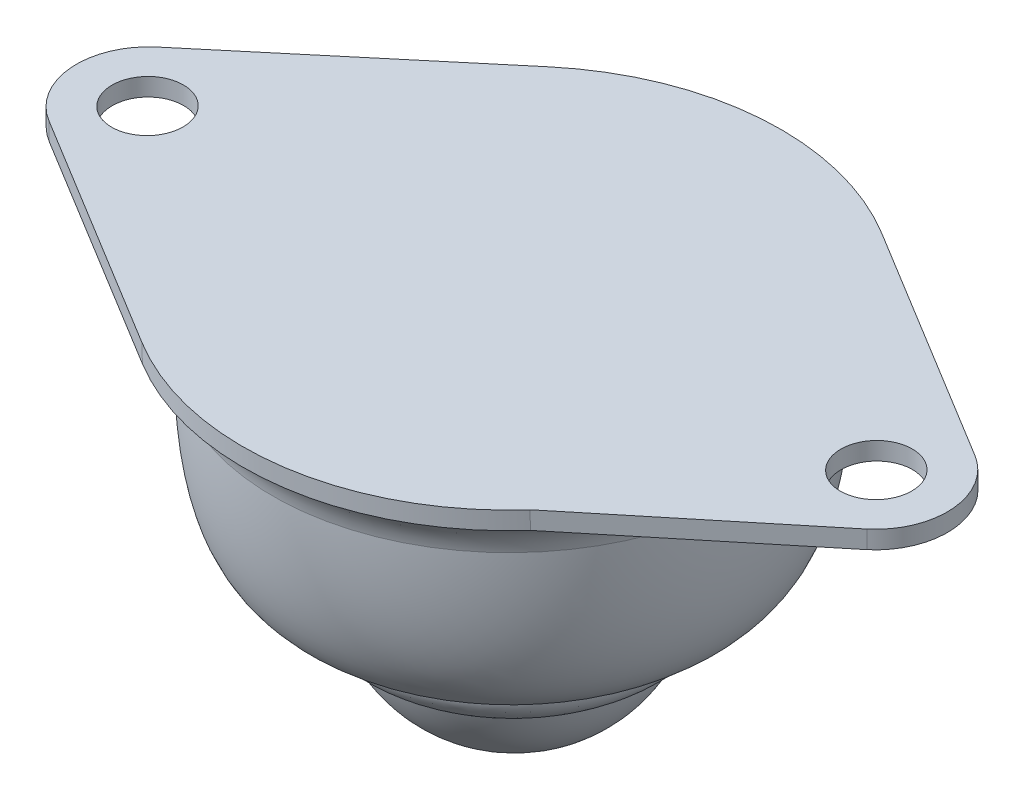
ISO-10303-21;
HEADER;
FILE_DESCRIPTION(('STEP AP214'),'2;1');
FILE_NAME('part.step','',(''),(''),'','','');
FILE_SCHEMA(('AUTOMOTIVE_DESIGN { 1 0 10303 214 1 1 1 1 }'));
ENDSEC;
DATA;
#1=APPLICATION_CONTEXT('core data for automotive mechanical design processes');
#2=APPLICATION_PROTOCOL_DEFINITION('international standard','automotive_design',2000,#1);
#3=PRODUCT_CONTEXT('',#1,'mechanical');
#4=PRODUCT('Part','Part','',(#3));
#5=PRODUCT_RELATED_PRODUCT_CATEGORY('part','',(#4));
#6=PRODUCT_DEFINITION_FORMATION('','',#4);
#7=PRODUCT_DEFINITION_CONTEXT('part definition',#1,'design');
#8=PRODUCT_DEFINITION('design','',#6,#7);
#9=PRODUCT_DEFINITION_SHAPE('','',#8);
#10=(LENGTH_UNIT() NAMED_UNIT(*) SI_UNIT(.MILLI.,.METRE.));
#11=(NAMED_UNIT(*) PLANE_ANGLE_UNIT() SI_UNIT($,.RADIAN.));
#12=(NAMED_UNIT(*) SI_UNIT($,.STERADIAN.) SOLID_ANGLE_UNIT());
#13=UNCERTAINTY_MEASURE_WITH_UNIT(LENGTH_MEASURE(1.E-05),#10,'distance_accuracy_value','');
#14=(GEOMETRIC_REPRESENTATION_CONTEXT(3) GLOBAL_UNCERTAINTY_ASSIGNED_CONTEXT((#13)) GLOBAL_UNIT_ASSIGNED_CONTEXT((#10,
#11,#12)) REPRESENTATION_CONTEXT('',''));
#15=CARTESIAN_POINT('',(0.,0.,0.));
#16=DIRECTION('',(0.,0.,1.));
#17=DIRECTION('',(1.,0.,0.));
#18=AXIS2_PLACEMENT_3D('',#15,#16,#17);
#19=CARTESIAN_POINT('',(20.6055140305361,-15.2825221419001,143.883208807288));
#20=DIRECTION('',(0.,0.999945430194424,0.0104468480073327));
#21=DIRECTION('',(0.0713413271941377,-0.0104202290339659,0.997397530506798));
#22=AXIS2_PLACEMENT_3D('',#19,#20,#21);
#23=PLANE('',#22);
#24=CARTESIAN_POINT('',(39.5571012945976,-15.2683615938651,142.527797559164));
#25=DIRECTION('',(0.,0.999945430194424,0.0104468480073327));
#26=DIRECTION('',(0.0713413271941377,-0.0104202290339659,0.997397530506798));
#27=AXIS2_PLACEMENT_3D('',#24,#25,#26);
#28=CIRCLE('',#27,2.);
#29=CARTESIAN_POINT('',(39.6997839489859,-15.2892020519331,144.522592620178));
#30=VERTEX_POINT('',#29);
#31=EDGE_CURVE('E112',#30,#30,#28,.T.);
#32=ORIENTED_EDGE('',*,*,#31,.T.);
#33=EDGE_LOOP('',(#32));
#34=FACE_BOUND('',#33,.T.);
#35=CARTESIAN_POINT('',(20.6055140305361,-15.2825221419001,143.883208807288));
#36=DIRECTION('',(0.,-0.999945430194424,-0.0104468480073327));
#37=DIRECTION('',(-0.0713413271941377,0.0104202290339659,-0.997397530506798));
#38=AXIS2_PLACEMENT_3D('',#35,#36,#37);
#39=CIRCLE('',#38,15.);
#40=CARTESIAN_POINT('',(28.3950586243151,-15.1486055318455,131.065055220945));
#41=VERTEX_POINT('',#40);
#42=CARTESIAN_POINT('',(31.7081173338485,-15.3878915387519,153.968896546827));
#43=VERTEX_POINT('',#42);
#44=EDGE_CURVE('E26',#41,#43,#39,.T.);
#45=ORIENTED_EDGE('',*,*,#44,.F.);
#46=DIRECTION('',(0.854590207244327,-0.00542507922783681,0.519274634656335));
#47=VECTOR('',#46,1.);
#48=CARTESIAN_POINT('',(28.3950586243151,-15.1486055318455,131.065055220945));
#49=LINE('',#48,#47);
#50=CARTESIAN_POINT('',(41.634313186272,-15.2326504978506,139.109623269472));
#51=VERTEX_POINT('',#50);
#52=EDGE_CURVE('E115',#41,#51,#49,.T.);
#53=ORIENTED_EDGE('',*,*,#52,.T.);
#54=CARTESIAN_POINT('',(39.5571012945976,-15.2683615938651,142.527797559164));
#55=DIRECTION('',(0.,0.999945430194424,0.0104468480073327));
#56=DIRECTION('',(0.0713413271941377,-0.0104202290339659,0.997397530506798));
#57=AXIS2_PLACEMENT_3D('',#54,#55,#56);
#58=CIRCLE('',#57,4.);
#59=CARTESIAN_POINT('',(42.112644401564,-15.300508701753,145.604836069142));
#60=VERTEX_POINT('',#59);
#61=EDGE_CURVE('E133',#60,#51,#58,.T.);
#62=ORIENTED_EDGE('',*,*,#61,.F.);
#63=DIRECTION('',(-0.779372261403576,-0.00654558913023889,0.626526961445088));
#64=VECTOR('',#63,1.);
#65=CARTESIAN_POINT('',(29.8895175935521,-15.4031651214567,155.430844611697));
#66=LINE('',#65,#64);
#67=EDGE_CURVE('E131',#60,#43,#66,.T.);
#68=ORIENTED_EDGE('',*,*,#67,.T.);
#69=EDGE_LOOP('',(#45,#53,#62,#68));
#70=FACE_BOUND('',#69,.T.);
#71=ADVANCED_FACE('F15',(#34,#70),#23,.F.);
#72=CARTESIAN_POINT('',(1.65392676647455,-15.296682689935,145.238620055412));
#73=DIRECTION('',(0.,0.999945430194424,0.0104468480073327));
#74=DIRECTION('',(0.0713413271941377,-0.0104202290339659,0.997397530506798));
#75=AXIS2_PLACEMENT_3D('',#72,#73,#74);
#76=CIRCLE('',#75,2.);
#77=CARTESIAN_POINT('',(1.79660942086283,-15.3175231480029,147.233415116425));
#78=VERTEX_POINT('',#77);
#79=EDGE_CURVE('E109',#78,#78,#76,.T.);
#80=ORIENTED_EDGE('',*,*,#79,.T.);
#81=EDGE_LOOP('',(#80));
#82=FACE_BOUND('',#81,.T.);
#83=CARTESIAN_POINT('',(12.815969436757,-15.4164387519546,156.701362393631));
#84=VERTEX_POINT('',#83);
#85=CARTESIAN_POINT('',(11.0708929812672,-15.1615500771406,132.304073813413));
#86=VERTEX_POINT('',#85);
#87=EDGE_CURVE('E10',#84,#86,#39,.T.);
#88=ORIENTED_EDGE('',*,*,#87,.F.);
#89=DIRECTION('',(0.854590207244327,-0.0054250792278368,0.519274634656334));
#90=VECTOR('',#89,1.);
#91=CARTESIAN_POINT('',(12.815969436757,-15.4164387519546,156.701362393631));
#92=LINE('',#91,#90);
#93=CARTESIAN_POINT('',(-0.423285125199856,-15.3323937859495,148.656794345103));
#94=VERTEX_POINT('',#93);
#95=EDGE_CURVE('E127',#94,#84,#92,.T.);
#96=ORIENTED_EDGE('',*,*,#95,.F.);
#97=CARTESIAN_POINT('',(1.65392676647455,-15.296682689935,145.238620055412));
#98=DIRECTION('',(0.,0.999945430194424,0.0104468480073327));
#99=DIRECTION('',(0.0713413271941377,-0.0104202290339659,0.997397530506798));
#100=AXIS2_PLACEMENT_3D('',#97,#98,#99);
#101=CIRCLE('',#100,4.);
#102=CARTESIAN_POINT('',(-0.888638846663823,-15.2644234726658,142.150850723712));
#103=VERTEX_POINT('',#102);
#104=EDGE_CURVE('E124',#103,#94,#101,.T.);
#105=ORIENTED_EDGE('',*,*,#104,.F.);
#106=DIRECTION('',(0.771984459966905,0.00664044912728166,-0.6356067164568));
#107=VECTOR('',#106,1.);
#108=CARTESIAN_POINT('',(11.0708929812672,-15.1615500771406,132.304073813413));
#109=LINE('',#108,#107);
#110=EDGE_CURVE('E121',#103,#86,#109,.T.);
#111=ORIENTED_EDGE('',*,*,#110,.T.);
#112=EDGE_LOOP('',(#88,#96,#105,#111));
#113=FACE_BOUND('',#112,.T.);
#114=ADVANCED_FACE('F208',(#82,#113),#23,.F.);
#115=CARTESIAN_POINT('',(28.3950586243151,-14.1486601016511,131.075502068952));
#116=DIRECTION('',(0.519302972918602,0.00892777400363633,-0.854543572422871));
#117=DIRECTION('',(-0.854590207244327,0.00542507922783681,-0.519274634656335));
#118=AXIS2_PLACEMENT_3D('',#115,#116,#117);
#119=PLANE('',#118);
#120=ORIENTED_EDGE('',*,*,#52,.F.);
#121=DIRECTION('',(0.,-0.999945430194424,-0.0104468480073327));
#122=VECTOR('',#121,1.);
#123=CARTESIAN_POINT('',(28.3950586243151,-14.1486601016511,131.075502068952));
#124=LINE('',#123,#122);
#125=CARTESIAN_POINT('',(28.3950586243151,-14.1486601016511,131.075502068952));
#126=VERTEX_POINT('',#125);
#127=EDGE_CURVE('E19',#126,#41,#124,.T.);
#128=ORIENTED_EDGE('',*,*,#127,.F.);
#129=DIRECTION('',(0.854590207244327,-0.00542507922783681,0.519274634656335));
#130=VECTOR('',#129,1.);
#131=CARTESIAN_POINT('',(28.3950586243151,-14.1486601016511,131.075502068952));
#132=LINE('',#131,#130);
#133=CARTESIAN_POINT('',(41.634313186272,-14.2327050676562,139.12007011748));
#134=VERTEX_POINT('',#133);
#135=EDGE_CURVE('E172',#126,#134,#132,.T.);
#136=ORIENTED_EDGE('',*,*,#135,.T.);
#137=DIRECTION('',(0.,-0.999945430194424,-0.0104468480073327));
#138=VECTOR('',#137,1.);
#139=CARTESIAN_POINT('',(41.634313186272,-14.2327050676562,139.12007011748));
#140=LINE('',#139,#138);
#141=EDGE_CURVE('E60',#134,#51,#140,.T.);
#142=ORIENTED_EDGE('',*,*,#141,.T.);
#143=EDGE_LOOP('',(#120,#128,#136,#142));
#144=FACE_BOUND('',#143,.T.);
#145=ADVANCED_FACE('F156',(#144),#119,.T.);
#146=CARTESIAN_POINT('',(20.6055140305361,-14.2825767117056,143.893655655295));
#147=DIRECTION('',(0.,-0.999945430194424,-0.0104468480073327));
#148=DIRECTION('',(-0.0713413271941377,0.0104202290339659,-0.997397530506798));
#149=AXIS2_PLACEMENT_3D('',#146,#147,#148);
#150=CYLINDRICAL_SURFACE('',#149,15.);
#151=CARTESIAN_POINT('',(20.6055140305361,-15.2825221419001,143.883208807288));
#152=DIRECTION('',(0.,0.999945430194424,0.0104468480073327));
#153=DIRECTION('',(0.0713413271941377,-0.0104202290339659,0.997397530506798));
#154=AXIS2_PLACEMENT_3D('',#151,#152,#153);
#155=CIRCLE('',#154,15.);
#156=EDGE_CURVE('E118',#41,#86,#155,.T.);
#157=ORIENTED_EDGE('',*,*,#156,.T.);
#158=DIRECTION('',(0.,-0.999945430194424,-0.0104468480073327));
#159=VECTOR('',#158,1.);
#160=CARTESIAN_POINT('',(11.0708929812672,-14.1616046469462,132.31452066142));
#161=LINE('',#160,#159);
#162=CARTESIAN_POINT('',(11.0708929812672,-14.1616046469462,132.31452066142));
#163=VERTEX_POINT('',#162);
#164=EDGE_CURVE('E143',#163,#86,#161,.T.);
#165=ORIENTED_EDGE('',*,*,#164,.F.);
#166=CARTESIAN_POINT('',(20.6055140305361,-14.2825767117056,143.893655655295));
#167=DIRECTION('',(0.,0.999945430194424,0.0104468480073327));
#168=DIRECTION('',(0.0713413271941377,-0.0104202290339659,0.997397530506798));
#169=AXIS2_PLACEMENT_3D('',#166,#167,#168);
#170=CIRCLE('',#169,15.);
#171=EDGE_CURVE('E153',#126,#163,#170,.T.);
#172=ORIENTED_EDGE('',*,*,#171,.F.);
#173=ORIENTED_EDGE('',*,*,#127,.T.);
#174=EDGE_LOOP('',(#157,#165,#172,#173));
#175=FACE_BOUND('',#174,.T.);
#176=ADVANCED_FACE('F151',(#175),#150,.T.);
#177=CARTESIAN_POINT('',(11.0708929812672,-14.1616046469462,132.31452066142));
#178=DIRECTION('',(-0.635641403284593,0.00806480431729719,-0.771942332925016));
#179=DIRECTION('',(-0.771984459966905,-0.00664044912728166,0.6356067164568));
#180=AXIS2_PLACEMENT_3D('',#177,#178,#179);
#181=PLANE('',#180);
#182=ORIENTED_EDGE('',*,*,#110,.F.);
#183=DIRECTION('',(0.,-0.999945430194424,-0.0104468480073327));
#184=VECTOR('',#183,1.);
#185=CARTESIAN_POINT('',(-0.888638846663823,-14.2644780424714,142.161297571719));
#186=LINE('',#185,#184);
#187=CARTESIAN_POINT('',(-0.888638846663823,-14.2644780424714,142.161297571719));
#188=VERTEX_POINT('',#187);
#189=EDGE_CURVE('E142',#188,#103,#186,.T.);
#190=ORIENTED_EDGE('',*,*,#189,.F.);
#191=DIRECTION('',(0.771984459966905,0.00664044912728166,-0.6356067164568));
#192=VECTOR('',#191,1.);
#193=CARTESIAN_POINT('',(11.0708929812672,-14.1616046469462,132.31452066142));
#194=LINE('',#193,#192);
#195=EDGE_CURVE('E175',#188,#163,#194,.T.);
#196=ORIENTED_EDGE('',*,*,#195,.T.);
#197=ORIENTED_EDGE('',*,*,#164,.T.);
#198=EDGE_LOOP('',(#182,#190,#196,#197));
#199=FACE_BOUND('',#198,.T.);
#200=ADVANCED_FACE('F227',(#199),#181,.T.);
#201=CARTESIAN_POINT('',(1.65392676647455,-14.2967372597406,145.249066903419));
#202=DIRECTION('',(0.,-0.999945430194424,-0.0104468480073327));
#203=DIRECTION('',(-0.0713413271941377,0.0104202290339659,-0.997397530506798));
#204=AXIS2_PLACEMENT_3D('',#201,#202,#203);
#205=CYLINDRICAL_SURFACE('',#204,4.);
#206=ORIENTED_EDGE('',*,*,#104,.T.);
#207=DIRECTION('',(0.,-0.999945430194424,-0.0104468480073327));
#208=VECTOR('',#207,1.);
#209=CARTESIAN_POINT('',(-0.423285125199856,-14.3324483557551,148.667241193111));
#210=LINE('',#209,#208);
#211=CARTESIAN_POINT('',(-0.423285125199856,-14.3324483557551,148.667241193111));
#212=VERTEX_POINT('',#211);
#213=EDGE_CURVE('E139',#212,#94,#210,.T.);
#214=ORIENTED_EDGE('',*,*,#213,.F.);
#215=CARTESIAN_POINT('',(1.65392676647455,-14.2967372597406,145.249066903419));
#216=DIRECTION('',(0.,0.999945430194424,0.0104468480073327));
#217=DIRECTION('',(0.0713413271941377,-0.0104202290339659,0.997397530506798));
#218=AXIS2_PLACEMENT_3D('',#215,#216,#217);
#219=CIRCLE('',#218,4.);
#220=EDGE_CURVE('E177',#188,#212,#219,.T.);
#221=ORIENTED_EDGE('',*,*,#220,.F.);
#222=ORIENTED_EDGE('',*,*,#189,.T.);
#223=EDGE_LOOP('',(#206,#214,#221,#222));
#224=FACE_BOUND('',#223,.T.);
#225=ADVANCED_FACE('F182',(#224),#205,.T.);
#226=CARTESIAN_POINT('',(12.815969436757,-14.4164933217602,156.711809241638));
#227=DIRECTION('',(0.519302972918602,0.00892777400363633,-0.854543572422871));
#228=DIRECTION('',(-0.854590207244327,0.0054250792278368,-0.519274634656334));
#229=AXIS2_PLACEMENT_3D('',#226,#227,#228);
#230=PLANE('',#229);
#231=ORIENTED_EDGE('',*,*,#95,.T.);
#232=DIRECTION('',(0.,-0.999945430194424,-0.0104468480073327));
#233=VECTOR('',#232,1.);
#234=CARTESIAN_POINT('',(12.815969436757,-14.4164933217602,156.711809241638));
#235=LINE('',#234,#233);
#236=CARTESIAN_POINT('',(12.815969436757,-14.4164933217602,156.711809241638));
#237=VERTEX_POINT('',#236);
#238=EDGE_CURVE('E102',#237,#84,#235,.T.);
#239=ORIENTED_EDGE('',*,*,#238,.F.);
#240=DIRECTION('',(0.854590207244327,-0.0054250792278368,0.519274634656334));
#241=VECTOR('',#240,1.);
#242=CARTESIAN_POINT('',(12.815969436757,-14.4164933217602,156.711809241638));
#243=LINE('',#242,#241);
#244=EDGE_CURVE('E87',#212,#237,#243,.T.);
#245=ORIENTED_EDGE('',*,*,#244,.F.);
#246=ORIENTED_EDGE('',*,*,#213,.T.);
#247=EDGE_LOOP('',(#231,#239,#245,#246));
#248=FACE_BOUND('',#247,.T.);
#249=ADVANCED_FACE('F185',(#248),#230,.F.);
#250=CARTESIAN_POINT('',(20.6055140305361,-14.2825767117056,143.893655655295));
#251=DIRECTION('',(0.,-0.999945430194424,-0.0104468480073327));
#252=DIRECTION('',(-0.0713413271941377,0.0104202290339659,-0.997397530506798));
#253=AXIS2_PLACEMENT_3D('',#250,#251,#252);
#254=CYLINDRICAL_SURFACE('',#253,15.);
#255=CARTESIAN_POINT('',(20.6055140305361,-15.2825221419001,143.883208807288));
#256=DIRECTION('',(0.,0.999945430194424,0.0104468480073327));
#257=DIRECTION('',(0.0713413271941377,-0.0104202290339659,0.997397530506798));
#258=AXIS2_PLACEMENT_3D('',#255,#256,#257);
#259=CIRCLE('',#258,15.);
#260=EDGE_CURVE('E98',#84,#43,#259,.T.);
#261=ORIENTED_EDGE('',*,*,#260,.T.);
#262=DIRECTION('',(0.,-0.999945430194424,-0.0104468480073327));
#263=VECTOR('',#262,1.);
#264=CARTESIAN_POINT('',(31.7081173338485,-14.3879461085575,153.979343394834));
#265=LINE('',#264,#263);
#266=CARTESIAN_POINT('',(31.7081173338485,-14.3879461085575,153.979343394834));
#267=VERTEX_POINT('',#266);
#268=EDGE_CURVE('E94',#267,#43,#265,.T.);
#269=ORIENTED_EDGE('',*,*,#268,.F.);
#270=CARTESIAN_POINT('',(20.6055140305361,-14.2825767117056,143.893655655295));
#271=DIRECTION('',(0.,0.999945430194424,0.0104468480073327));
#272=DIRECTION('',(0.0713413271941377,-0.0104202290339659,0.997397530506798));
#273=AXIS2_PLACEMENT_3D('',#270,#271,#272);
#274=CIRCLE('',#273,15.);
#275=EDGE_CURVE('E81',#237,#267,#274,.T.);
#276=ORIENTED_EDGE('',*,*,#275,.F.);
#277=ORIENTED_EDGE('',*,*,#238,.T.);
#278=EDGE_LOOP('',(#261,#269,#276,#277));
#279=FACE_BOUND('',#278,.T.);
#280=ADVANCED_FACE('F95',(#279),#254,.T.);
#281=CARTESIAN_POINT('',(29.8895175935521,-14.4032196912623,155.441291459704));
#282=DIRECTION('',(0.626561152765376,-0.00814198355601444,0.779329731210799));
#283=DIRECTION('',(0.779372261403576,0.00654558913023889,-0.626526961445088));
#284=AXIS2_PLACEMENT_3D('',#281,#282,#283);
#285=PLANE('',#284);
#286=ORIENTED_EDGE('',*,*,#67,.F.);
#287=DIRECTION('',(0.,-0.999945430194424,-0.0104468480073327));
#288=VECTOR('',#287,1.);
#289=CARTESIAN_POINT('',(42.112644401564,-14.3005632715586,145.61528291715));
#290=LINE('',#289,#288);
#291=CARTESIAN_POINT('',(42.112644401564,-14.3005632715586,145.61528291715));
#292=VERTEX_POINT('',#291);
#293=EDGE_CURVE('E53',#292,#60,#290,.T.);
#294=ORIENTED_EDGE('',*,*,#293,.F.);
#295=DIRECTION('',(-0.779372261403576,-0.00654558913023889,0.626526961445088));
#296=VECTOR('',#295,1.);
#297=CARTESIAN_POINT('',(29.8895175935521,-14.4032196912623,155.441291459704));
#298=LINE('',#297,#296);
#299=EDGE_CURVE('E85',#292,#267,#298,.T.);
#300=ORIENTED_EDGE('',*,*,#299,.T.);
#301=ORIENTED_EDGE('',*,*,#268,.T.);
#302=EDGE_LOOP('',(#286,#294,#300,#301));
#303=FACE_BOUND('',#302,.T.);
#304=ADVANCED_FACE('F104',(#303),#285,.T.);
#305=CARTESIAN_POINT('',(39.5571012945976,-14.2684161636707,142.538244407171));
#306=DIRECTION('',(0.,-0.999945430194424,-0.0104468480073327));
#307=DIRECTION('',(-0.0713413271941377,0.0104202290339659,-0.997397530506798));
#308=AXIS2_PLACEMENT_3D('',#305,#306,#307);
#309=CYLINDRICAL_SURFACE('',#308,2.);
#310=CARTESIAN_POINT('',(39.5571012945976,-14.2684161636707,142.538244407171));
#311=DIRECTION('',(0.,0.999945430194424,0.0104468480073327));
#312=DIRECTION('',(0.0713413271941377,-0.0104202290339659,0.997397530506798));
#313=AXIS2_PLACEMENT_3D('',#310,#311,#312);
#314=CIRCLE('',#313,2.);
#315=CARTESIAN_POINT('',(39.6997839489859,-14.2892566217386,144.533039468185));
#316=VERTEX_POINT('',#315);
#317=EDGE_CURVE('E169',#316,#316,#314,.T.);
#318=ORIENTED_EDGE('',*,*,#317,.T.);
#319=EDGE_LOOP('',(#318));
#320=FACE_BOUND('',#319,.T.);
#321=ORIENTED_EDGE('',*,*,#31,.F.);
#322=EDGE_LOOP('',(#321));
#323=FACE_BOUND('',#322,.T.);
#324=ADVANCED_FACE('F220',(#320,#323),#309,.F.);
#325=CARTESIAN_POINT('',(1.65392676647455,-14.2967372597406,145.249066903419));
#326=DIRECTION('',(0.,-0.999945430194424,-0.0104468480073327));
#327=DIRECTION('',(-0.0713413271941377,0.0104202290339659,-0.997397530506798));
#328=AXIS2_PLACEMENT_3D('',#325,#326,#327);
#329=CYLINDRICAL_SURFACE('',#328,2.);
#330=CARTESIAN_POINT('',(1.65392676647455,-14.2967372597406,145.249066903419));
#331=DIRECTION('',(0.,0.999945430194424,0.0104468480073327));
#332=DIRECTION('',(0.0713413271941377,-0.0104202290339659,0.997397530506798));
#333=AXIS2_PLACEMENT_3D('',#330,#331,#332);
#334=CIRCLE('',#333,2.);
#335=CARTESIAN_POINT('',(1.79660942086283,-14.3175777178085,147.243861964433));
#336=VERTEX_POINT('',#335);
#337=EDGE_CURVE('E135',#336,#336,#334,.T.);
#338=ORIENTED_EDGE('',*,*,#337,.T.);
#339=EDGE_LOOP('',(#338));
#340=FACE_BOUND('',#339,.T.);
#341=ORIENTED_EDGE('',*,*,#79,.F.);
#342=EDGE_LOOP('',(#341));
#343=FACE_BOUND('',#342,.T.);
#344=ADVANCED_FACE('F17',(#340,#343),#329,.F.);
#345=CARTESIAN_POINT('',(39.5571012945976,-14.2684161636707,142.538244407171));
#346=DIRECTION('',(0.,-0.999945430194424,-0.0104468480073327));
#347=DIRECTION('',(-0.0713413271941377,0.0104202290339659,-0.997397530506798));
#348=AXIS2_PLACEMENT_3D('',#345,#346,#347);
#349=CYLINDRICAL_SURFACE('',#348,4.);
#350=ORIENTED_EDGE('',*,*,#61,.T.);
#351=ORIENTED_EDGE('',*,*,#141,.F.);
#352=CARTESIAN_POINT('',(39.5571012945976,-14.2684161636707,142.538244407171));
#353=DIRECTION('',(0.,0.999945430194424,0.0104468480073327));
#354=DIRECTION('',(0.0713413271941377,-0.0104202290339659,0.997397530506798));
#355=AXIS2_PLACEMENT_3D('',#352,#353,#354);
#356=CIRCLE('',#355,4.);
#357=EDGE_CURVE('E34',#292,#134,#356,.T.);
#358=ORIENTED_EDGE('',*,*,#357,.F.);
#359=ORIENTED_EDGE('',*,*,#293,.T.);
#360=EDGE_LOOP('',(#350,#351,#358,#359));
#361=FACE_BOUND('',#360,.T.);
#362=ADVANCED_FACE('F202',(#361),#349,.T.);
#363=CARTESIAN_POINT('',(20.6055140305361,-14.2825767117056,143.893655655295));
#364=DIRECTION('',(0.,0.999945430194424,0.0104468480073327));
#365=DIRECTION('',(0.0713413271941377,-0.0104202290339659,0.997397530506798));
#366=AXIS2_PLACEMENT_3D('',#363,#364,#365);
#367=PLANE('',#366);
#368=ORIENTED_EDGE('',*,*,#337,.F.);
#369=EDGE_LOOP('',(#368));
#370=FACE_BOUND('',#369,.T.);
#371=ORIENTED_EDGE('',*,*,#317,.F.);
#372=EDGE_LOOP('',(#371));
#373=FACE_BOUND('',#372,.T.);
#374=ORIENTED_EDGE('',*,*,#135,.F.);
#375=ORIENTED_EDGE('',*,*,#171,.T.);
#376=ORIENTED_EDGE('',*,*,#195,.F.);
#377=ORIENTED_EDGE('',*,*,#220,.T.);
#378=ORIENTED_EDGE('',*,*,#244,.T.);
#379=ORIENTED_EDGE('',*,*,#275,.T.);
#380=ORIENTED_EDGE('',*,*,#299,.F.);
#381=ORIENTED_EDGE('',*,*,#357,.T.);
#382=EDGE_LOOP('',(#374,#375,#376,#377,#378,#379,#380,#381));
#383=FACE_BOUND('',#382,.T.);
#384=ADVANCED_FACE('F83',(#370,#373,#383),#367,.T.);
#385=CARTESIAN_POINT('',(20.6055140305361,-35.2814307457886,143.674271847141));
#386=CARTESIAN_POINT('',(15.3327179454782,-34.7081371454457,144.057411076649));
#387=CARTESIAN_POINT('',(13.6233503016713,-30.0806529334509,144.228023090923));
#388=B_SPLINE_CURVE_WITH_KNOTS('',2,(#385,#386,#387),.UNSPECIFIED.,.F.,.F.,(3,3),(0.,1.),.UNSPECIFIED.);
#389=CARTESIAN_POINT('',(20.6055140305361,-35.2814307457886,143.674271847141));
#390=DIRECTION('',(0.,-0.999945430194424,-0.0104468480073327));
#391=AXIS1_PLACEMENT('',#389,#390);
#392=SURFACE_OF_REVOLUTION('',#388,#391);
#393=CARTESIAN_POINT('',(20.6055140305361,-30.075435889438,143.728661052141));
#394=DIRECTION('',(0.,-0.999945430194424,-0.0104468480073327));
#395=DIRECTION('',(-0.0713413271941377,0.0104202290339659,-0.997397530506798));
#396=AXIS2_PLACEMENT_3D('',#393,#394,#395);
#397=CIRCLE('',#396,7.);
#398=CARTESIAN_POINT('',(20.1061247401771,-30.0024942862003,136.746878338593));
#399=VERTEX_POINT('',#398);
#400=EDGE_CURVE('E259',#399,#399,#397,.T.);
#401=ORIENTED_EDGE('',*,*,#400,.T.);
#402=EDGE_LOOP('',(#401));
#403=FACE_BOUND('',#402,.T.);
#404=CARTESIAN_POINT('',(20.6055140305361,-35.2814307457886,143.674271847141));
#405=VERTEX_POINT('',#404);
#406=VERTEX_LOOP('',#405);
#407=FACE_BOUND('',#406,.T.);
#408=ADVANCED_FACE('F190',(#403,#407),#392,.F.);
#409=CARTESIAN_POINT('',(7.28777986513233,-17.5430374422129,144.812176159898));
#410=CARTESIAN_POINT('',(7.00440563232507,-15.8742637701667,144.849879579627));
#411=CARTESIAN_POINT('',(5.64373461154013,-15.2937015219276,144.953270318965));
#412=B_SPLINE_CURVE_WITH_KNOTS('',2,(#409,#410,#411),.UNSPECIFIED.,.F.,.F.,(3,3),(0.,1.),.UNSPECIFIED.);
#413=CARTESIAN_POINT('',(20.6055140305361,-35.2814307457886,143.674271847141));
#414=DIRECTION('',(0.,-0.999945430194424,-0.0104468480073327));
#415=AXIS1_PLACEMENT('',#413,#414);
#416=SURFACE_OF_REVOLUTION('',#412,#415);
#417=ORIENTED_EDGE('',*,*,#44,.T.);
#418=ORIENTED_EDGE('',*,*,#260,.F.);
#419=ORIENTED_EDGE('',*,*,#87,.T.);
#420=ORIENTED_EDGE('',*,*,#156,.F.);
#421=EDGE_LOOP('',(#417,#418,#419,#420));
#422=FACE_BOUND('',#421,.T.);
#423=CARTESIAN_POINT('',(20.6055140305361,-17.5330864860351,143.859696220577));
#424=DIRECTION('',(0.,-0.999945430194424,-0.0104468480073327));
#425=DIRECTION('',(-0.0713413271941377,0.0104202290339659,-0.997397530506798));
#426=AXIS2_PLACEMENT_3D('',#423,#424,#425);
#427=CIRCLE('',#426,13.3517549541886);
#428=CARTESIAN_POINT('',(19.6529821117334,-17.393958141407,130.542688801337));
#429=VERTEX_POINT('',#428);
#430=EDGE_CURVE('E161',#429,#429,#427,.T.);
#431=ORIENTED_EDGE('',*,*,#430,.F.);
#432=EDGE_LOOP('',(#431));
#433=FACE_BOUND('',#432,.T.);
#434=ADVANCED_FACE('F192',(#422,#433),#416,.F.);
#435=CARTESIAN_POINT('',(11.9918200964289,-27.7097409583018,144.369492236057));
#436=CARTESIAN_POINT('',(9.70130238140064,-27.0486192081438,144.540234200619));
#437=CARTESIAN_POINT('',(7.25430182541751,-26.1631927128532,144.724512393176));
#438=CARTESIAN_POINT('',(7.28777986513233,-17.5430374422129,144.812176159898));
#439=B_SPLINE_CURVE_WITH_KNOTS('',3,(#435,#436,#437,#438),.UNSPECIFIED.,.F.,.F.,(4,4),(0.,1.),.UNSPECIFIED.);
#440=CARTESIAN_POINT('',(20.6055140305361,-35.2814307457886,143.674271847141));
#441=DIRECTION('',(0.,-0.999945430194424,-0.0104468480073327));
#442=AXIS1_PLACEMENT('',#440,#441);
#443=SURFACE_OF_REVOLUTION('',#439,#442);
#444=ORIENTED_EDGE('',*,*,#430,.T.);
#445=EDGE_LOOP('',(#444));
#446=FACE_BOUND('',#445,.T.);
#447=CARTESIAN_POINT('',(20.6055140305361,-27.7033048416319,143.753443697035));
#448=DIRECTION('',(0.,-0.999945430194424,-0.0104468480073327));
#449=DIRECTION('',(-0.0713413271941377,0.0104202290339659,-0.997397530506798));
#450=AXIS2_PLACEMENT_3D('',#447,#448,#449);
#451=CIRCLE('',#450,8.63569802717213);
#452=CARTESIAN_POINT('',(19.9894318720298,-27.6133188903206,135.140219810531));
#453=VERTEX_POINT('',#452);
#454=EDGE_CURVE('E163',#453,#453,#451,.T.);
#455=ORIENTED_EDGE('',*,*,#454,.F.);
#456=EDGE_LOOP('',(#455));
#457=FACE_BOUND('',#456,.T.);
#458=ADVANCED_FACE('F200',(#446,#457),#443,.F.);
#459=CARTESIAN_POINT('',(13.6233503016713,-30.0806529334509,144.228023090923));
#460=CARTESIAN_POINT('',(11.6234590292289,-28.9814239927664,144.382554368802));
#461=CARTESIAN_POINT('',(11.9918200964289,-27.7097409583018,144.369492236057));
#462=B_SPLINE_CURVE_WITH_KNOTS('',2,(#459,#460,#461),.UNSPECIFIED.,.F.,.F.,(3,3),(0.,1.),.UNSPECIFIED.);
#463=CARTESIAN_POINT('',(20.6055140305361,-35.2814307457886,143.674271847141));
#464=DIRECTION('',(0.,-0.999945430194424,-0.0104468480073327));
#465=AXIS1_PLACEMENT('',#463,#464);
#466=SURFACE_OF_REVOLUTION('',#462,#465);
#467=ORIENTED_EDGE('',*,*,#454,.T.);
#468=EDGE_LOOP('',(#467));
#469=FACE_BOUND('',#468,.T.);
#470=ORIENTED_EDGE('',*,*,#400,.F.);
#471=EDGE_LOOP('',(#470));
#472=FACE_BOUND('',#471,.T.);
#473=ADVANCED_FACE('F254',(#469,#472),#466,.F.);
#474=CLOSED_SHELL('',(#71,#114,#145,#176,#200,#225,#249,#280,#304,#324,#344,#362,#384,#408,#434,
#458,#473));
#475=MANIFOLD_SOLID_BREP('B1',#474);
#476=ADVANCED_BREP_SHAPE_REPRESENTATION('',(#18,#475),#14);
#477=SHAPE_DEFINITION_REPRESENTATION(#9,#476);
ENDSEC;
END-ISO-10303-21;
